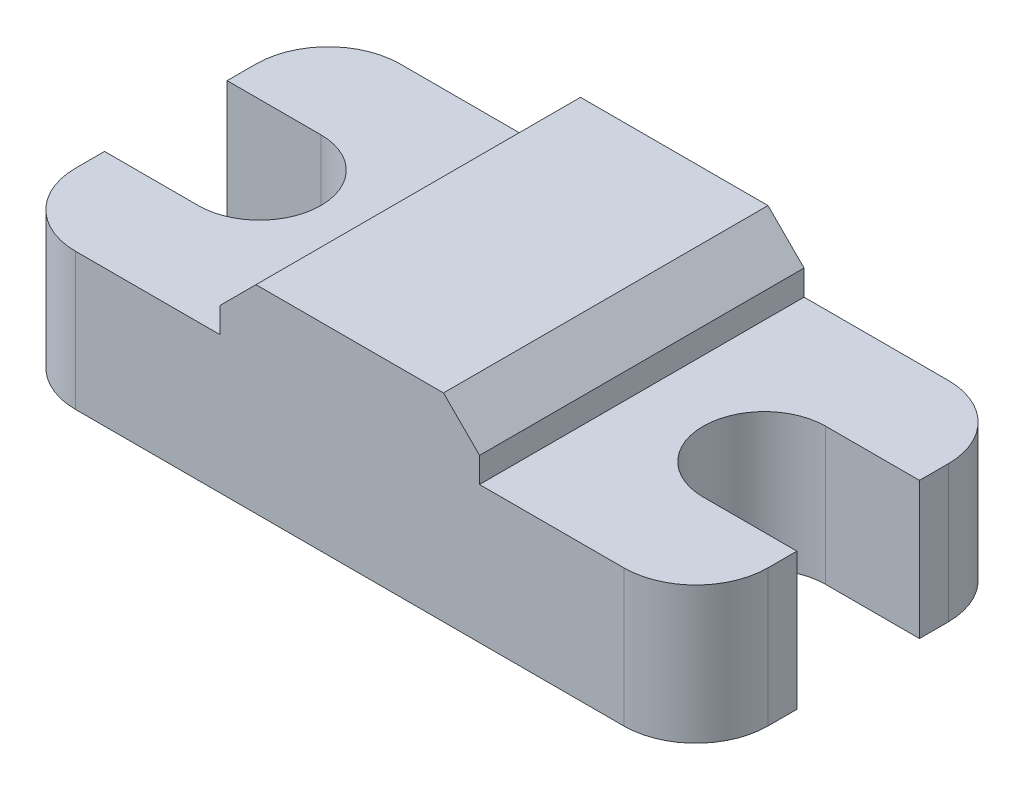
ISO-10303-21;
HEADER;
FILE_DESCRIPTION(('STEP AP214'),'2;1');
FILE_NAME('part.step','',(''),(''),'','','');
FILE_SCHEMA(('AUTOMOTIVE_DESIGN { 1 0 10303 214 1 1 1 1 }'));
ENDSEC;
DATA;
#1=APPLICATION_CONTEXT('core data for automotive mechanical design processes');
#2=APPLICATION_PROTOCOL_DEFINITION('international standard','automotive_design',2000,#1);
#3=PRODUCT_CONTEXT('',#1,'mechanical');
#4=PRODUCT('Part','Part','',(#3));
#5=PRODUCT_RELATED_PRODUCT_CATEGORY('part','',(#4));
#6=PRODUCT_DEFINITION_FORMATION('','',#4);
#7=PRODUCT_DEFINITION_CONTEXT('part definition',#1,'design');
#8=PRODUCT_DEFINITION('design','',#6,#7);
#9=PRODUCT_DEFINITION_SHAPE('','',#8);
#10=(LENGTH_UNIT() NAMED_UNIT(*) SI_UNIT(.MILLI.,.METRE.));
#11=(NAMED_UNIT(*) PLANE_ANGLE_UNIT() SI_UNIT($,.RADIAN.));
#12=(NAMED_UNIT(*) SI_UNIT($,.STERADIAN.) SOLID_ANGLE_UNIT());
#13=UNCERTAINTY_MEASURE_WITH_UNIT(LENGTH_MEASURE(1.E-05),#10,'distance_accuracy_value','');
#14=(GEOMETRIC_REPRESENTATION_CONTEXT(3) GLOBAL_UNCERTAINTY_ASSIGNED_CONTEXT((#13)) GLOBAL_UNIT_ASSIGNED_CONTEXT((#10,
#11,#12)) REPRESENTATION_CONTEXT('',''));
#15=CARTESIAN_POINT('',(0.,0.,0.));
#16=DIRECTION('',(0.,0.,1.));
#17=DIRECTION('',(1.,0.,0.));
#18=AXIS2_PLACEMENT_3D('',#15,#16,#17);
#19=CARTESIAN_POINT('',(2.,3.8,-7.));
#20=DIRECTION('',(0.,-1.,0.));
#21=DIRECTION('',(0.,0.,-1.));
#22=AXIS2_PLACEMENT_3D('',#19,#20,#21);
#23=PLANE('',#22);
#24=DIRECTION('',(0.,0.,-1.));
#25=VECTOR('',#24,1.);
#26=CARTESIAN_POINT('',(13.2,3.8,-9.));
#27=LINE('',#26,#25);
#28=CARTESIAN_POINT('',(13.2,3.8,0.));
#29=VERTEX_POINT('',#28);
#30=CARTESIAN_POINT('',(13.2,3.8,-9.));
#31=VERTEX_POINT('',#30);
#32=EDGE_CURVE('E205',#29,#31,#27,.T.);
#33=ORIENTED_EDGE('',*,*,#32,.F.);
#34=DIRECTION('',(1.,0.,0.));
#35=VECTOR('',#34,1.);
#36=CARTESIAN_POINT('',(2.00000000000001,3.8,0.));
#37=LINE('',#36,#35);
#38=CARTESIAN_POINT('',(17.2,3.8,0.));
#39=VERTEX_POINT('',#38);
#40=EDGE_CURVE('E200',#29,#39,#37,.T.);
#41=ORIENTED_EDGE('',*,*,#40,.T.);
#42=CARTESIAN_POINT('',(17.2,3.8,-2.));
#43=DIRECTION('',(0.,1.,0.));
#44=DIRECTION('',(0.,0.,1.));
#45=AXIS2_PLACEMENT_3D('',#42,#43,#44);
#46=CIRCLE('',#45,2.);
#47=CARTESIAN_POINT('',(19.2,3.8,-2.00000000000001));
#48=VERTEX_POINT('',#47);
#49=EDGE_CURVE('E199',#39,#48,#46,.T.);
#50=ORIENTED_EDGE('',*,*,#49,.T.);
#51=DIRECTION('',(0.,0.,-1.));
#52=VECTOR('',#51,1.);
#53=CARTESIAN_POINT('',(19.2,3.8,-2.00000000000001));
#54=LINE('',#53,#52);
#55=CARTESIAN_POINT('',(19.2,3.8,-2.8));
#56=VERTEX_POINT('',#55);
#57=EDGE_CURVE('E233',#48,#56,#54,.T.);
#58=ORIENTED_EDGE('',*,*,#57,.T.);
#59=DIRECTION('',(-1.,0.,0.));
#60=VECTOR('',#59,1.);
#61=CARTESIAN_POINT('',(19.2,3.8,-2.8));
#62=LINE('',#61,#60);
#63=CARTESIAN_POINT('',(16.6,3.8,-2.8));
#64=VERTEX_POINT('',#63);
#65=EDGE_CURVE('E235',#56,#64,#62,.T.);
#66=ORIENTED_EDGE('',*,*,#65,.T.);
#67=CARTESIAN_POINT('',(16.6,3.8,-4.5));
#68=DIRECTION('',(0.,-1.,0.));
#69=DIRECTION('',(0.,0.,1.));
#70=AXIS2_PLACEMENT_3D('',#67,#68,#69);
#71=CIRCLE('',#70,1.7);
#72=CARTESIAN_POINT('',(16.6,3.8,-6.2));
#73=VERTEX_POINT('',#72);
#74=EDGE_CURVE('E237',#64,#73,#71,.T.);
#75=ORIENTED_EDGE('',*,*,#74,.T.);
#76=DIRECTION('',(1.,0.,0.));
#77=VECTOR('',#76,1.);
#78=CARTESIAN_POINT('',(19.2,3.8,-6.2));
#79=LINE('',#78,#77);
#80=CARTESIAN_POINT('',(19.2,3.8,-6.2));
#81=VERTEX_POINT('',#80);
#82=EDGE_CURVE('E239',#73,#81,#79,.T.);
#83=ORIENTED_EDGE('',*,*,#82,.T.);
#84=DIRECTION('',(0.,0.,-1.));
#85=VECTOR('',#84,1.);
#86=CARTESIAN_POINT('',(19.2,3.8,-6.2));
#87=LINE('',#86,#85);
#88=CARTESIAN_POINT('',(19.2,3.8,-6.99999999999999));
#89=VERTEX_POINT('',#88);
#90=EDGE_CURVE('E241',#81,#89,#87,.T.);
#91=ORIENTED_EDGE('',*,*,#90,.T.);
#92=CARTESIAN_POINT('',(17.2,3.8,-7.));
#93=DIRECTION('',(0.,1.,0.));
#94=DIRECTION('',(0.,0.,-1.));
#95=AXIS2_PLACEMENT_3D('',#92,#93,#94);
#96=CIRCLE('',#95,2.);
#97=CARTESIAN_POINT('',(17.2,3.8,-9.));
#98=VERTEX_POINT('',#97);
#99=EDGE_CURVE('E243',#89,#98,#96,.T.);
#100=ORIENTED_EDGE('',*,*,#99,.T.);
#101=DIRECTION('',(-1.,0.,0.));
#102=VECTOR('',#101,1.);
#103=CARTESIAN_POINT('',(2.00000000000001,3.8,-9.));
#104=LINE('',#103,#102);
#105=EDGE_CURVE('E246',#98,#31,#104,.T.);
#106=ORIENTED_EDGE('',*,*,#105,.T.);
#107=EDGE_LOOP('',(#33,#41,#50,#58,#66,#75,#83,#91,#100,#106));
#108=FACE_BOUND('',#107,.T.);
#109=ADVANCED_FACE('F33',(#108),#23,.F.);
#110=DIRECTION('',(0.,0.,1.));
#111=VECTOR('',#110,1.);
#112=CARTESIAN_POINT('',(6.,3.8,-9.));
#113=LINE('',#112,#111);
#114=CARTESIAN_POINT('',(6.,3.8,-9.));
#115=VERTEX_POINT('',#114);
#116=CARTESIAN_POINT('',(6.,3.8,0.));
#117=VERTEX_POINT('',#116);
#118=EDGE_CURVE('E194',#115,#117,#113,.T.);
#119=ORIENTED_EDGE('',*,*,#118,.F.);
#120=CARTESIAN_POINT('',(2.00000000000001,3.8,-9.));
#121=VERTEX_POINT('',#120);
#122=EDGE_CURVE('E245',#115,#121,#104,.T.);
#123=ORIENTED_EDGE('',*,*,#122,.T.);
#124=CARTESIAN_POINT('',(2.,3.8,-7.));
#125=DIRECTION('',(0.,1.,0.));
#126=DIRECTION('',(0.,0.,-1.));
#127=AXIS2_PLACEMENT_3D('',#124,#125,#126);
#128=CIRCLE('',#127,2.);
#129=CARTESIAN_POINT('',(0.,3.8,-6.99999999999998));
#130=VERTEX_POINT('',#129);
#131=EDGE_CURVE('E249',#121,#130,#128,.T.);
#132=ORIENTED_EDGE('',*,*,#131,.T.);
#133=DIRECTION('',(0.,0.,1.));
#134=VECTOR('',#133,1.);
#135=CARTESIAN_POINT('',(0.,3.8,-6.2));
#136=LINE('',#135,#134);
#137=CARTESIAN_POINT('',(0.,3.8,-6.2));
#138=VERTEX_POINT('',#137);
#139=EDGE_CURVE('E219',#130,#138,#136,.T.);
#140=ORIENTED_EDGE('',*,*,#139,.T.);
#141=DIRECTION('',(1.,0.,0.));
#142=VECTOR('',#141,1.);
#143=CARTESIAN_POINT('',(0.,3.8,-6.2));
#144=LINE('',#143,#142);
#145=CARTESIAN_POINT('',(2.6,3.8,-6.2));
#146=VERTEX_POINT('',#145);
#147=EDGE_CURVE('E222',#138,#146,#144,.T.);
#148=ORIENTED_EDGE('',*,*,#147,.T.);
#149=CARTESIAN_POINT('',(2.6,3.8,-4.5));
#150=DIRECTION('',(0.,-1.,0.));
#151=DIRECTION('',(0.,0.,1.));
#152=AXIS2_PLACEMENT_3D('',#149,#150,#151);
#153=CIRCLE('',#152,1.7);
#154=CARTESIAN_POINT('',(2.6,3.8,-2.8));
#155=VERTEX_POINT('',#154);
#156=EDGE_CURVE('E225',#146,#155,#153,.T.);
#157=ORIENTED_EDGE('',*,*,#156,.T.);
#158=DIRECTION('',(-1.,0.,0.));
#159=VECTOR('',#158,1.);
#160=CARTESIAN_POINT('',(0.,3.8,-2.8));
#161=LINE('',#160,#159);
#162=CARTESIAN_POINT('',(0.,3.8,-2.8));
#163=VERTEX_POINT('',#162);
#164=EDGE_CURVE('E227',#155,#163,#161,.T.);
#165=ORIENTED_EDGE('',*,*,#164,.T.);
#166=DIRECTION('',(0.,0.,1.));
#167=VECTOR('',#166,1.);
#168=CARTESIAN_POINT('',(0.,3.8,-2.00000000000001));
#169=LINE('',#168,#167);
#170=CARTESIAN_POINT('',(0.,3.8,-2.00000000000001));
#171=VERTEX_POINT('',#170);
#172=EDGE_CURVE('E229',#163,#171,#169,.T.);
#173=ORIENTED_EDGE('',*,*,#172,.T.);
#174=CARTESIAN_POINT('',(2.,3.8,-2.));
#175=DIRECTION('',(0.,1.,0.));
#176=DIRECTION('',(0.,0.,-1.));
#177=AXIS2_PLACEMENT_3D('',#174,#175,#176);
#178=CIRCLE('',#177,2.);
#179=CARTESIAN_POINT('',(2.00000000000001,3.8,0.));
#180=VERTEX_POINT('',#179);
#181=EDGE_CURVE('E197',#171,#180,#178,.T.);
#182=ORIENTED_EDGE('',*,*,#181,.T.);
#183=EDGE_CURVE('E184',#180,#117,#37,.T.);
#184=ORIENTED_EDGE('',*,*,#183,.T.);
#185=EDGE_LOOP('',(#119,#123,#132,#140,#148,#157,#165,#173,#182,#184));
#186=FACE_BOUND('',#185,.T.);
#187=ADVANCED_FACE('F193',(#186),#23,.F.);
#188=CARTESIAN_POINT('',(0.,3.8,-6.2));
#189=DIRECTION('',(1.,0.,0.));
#190=DIRECTION('',(0.,0.,-1.));
#191=AXIS2_PLACEMENT_3D('',#188,#189,#190);
#192=PLANE('',#191);
#193=DIRECTION('',(0.,0.,1.));
#194=VECTOR('',#193,1.);
#195=CARTESIAN_POINT('',(0.,0.,-6.2));
#196=LINE('',#195,#194);
#197=CARTESIAN_POINT('',(0.,0.,-6.99999999999998));
#198=VERTEX_POINT('',#197);
#199=CARTESIAN_POINT('',(0.,0.,-6.2));
#200=VERTEX_POINT('',#199);
#201=EDGE_CURVE('E218',#198,#200,#196,.T.);
#202=ORIENTED_EDGE('',*,*,#201,.T.);
#203=DIRECTION('',(0.,-1.,0.));
#204=VECTOR('',#203,1.);
#205=CARTESIAN_POINT('',(0.,3.8,-6.2));
#206=LINE('',#205,#204);
#207=EDGE_CURVE('E326',#138,#200,#206,.T.);
#208=ORIENTED_EDGE('',*,*,#207,.F.);
#209=ORIENTED_EDGE('',*,*,#139,.F.);
#210=DIRECTION('',(0.,-1.,0.));
#211=VECTOR('',#210,1.);
#212=CARTESIAN_POINT('',(0.,3.8,-6.99999999999998));
#213=LINE('',#212,#211);
#214=EDGE_CURVE('E251',#130,#198,#213,.T.);
#215=ORIENTED_EDGE('',*,*,#214,.T.);
#216=EDGE_LOOP('',(#202,#208,#209,#215));
#217=FACE_BOUND('',#216,.T.);
#218=ADVANCED_FACE('F405',(#217),#192,.F.);
#219=CARTESIAN_POINT('',(0.,3.8,-6.2));
#220=DIRECTION('',(0.,0.,-1.));
#221=DIRECTION('',(-1.,0.,0.));
#222=AXIS2_PLACEMENT_3D('',#219,#220,#221);
#223=PLANE('',#222);
#224=DIRECTION('',(1.,0.,0.));
#225=VECTOR('',#224,1.);
#226=CARTESIAN_POINT('',(0.,0.,-6.2));
#227=LINE('',#226,#225);
#228=CARTESIAN_POINT('',(2.6,0.,-6.2));
#229=VERTEX_POINT('',#228);
#230=EDGE_CURVE('E254',#200,#229,#227,.T.);
#231=ORIENTED_EDGE('',*,*,#230,.T.);
#232=DIRECTION('',(0.,-1.,0.));
#233=VECTOR('',#232,1.);
#234=CARTESIAN_POINT('',(2.6,3.8,-6.2));
#235=LINE('',#234,#233);
#236=EDGE_CURVE('E323',#146,#229,#235,.T.);
#237=ORIENTED_EDGE('',*,*,#236,.F.);
#238=ORIENTED_EDGE('',*,*,#147,.F.);
#239=ORIENTED_EDGE('',*,*,#207,.T.);
#240=EDGE_LOOP('',(#231,#237,#238,#239));
#241=FACE_BOUND('',#240,.T.);
#242=ADVANCED_FACE('F459',(#241),#223,.F.);
#243=CARTESIAN_POINT('',(2.6,3.8,-4.5));
#244=DIRECTION('',(0.,-1.,0.));
#245=DIRECTION('',(0.,0.,-1.));
#246=AXIS2_PLACEMENT_3D('',#243,#244,#245);
#247=CYLINDRICAL_SURFACE('',#246,1.7);
#248=CARTESIAN_POINT('',(2.6,0.,-4.5));
#249=DIRECTION('',(0.,-1.,0.));
#250=DIRECTION('',(0.,0.,1.));
#251=AXIS2_PLACEMENT_3D('',#248,#249,#250);
#252=CIRCLE('',#251,1.7);
#253=CARTESIAN_POINT('',(2.6,0.,-2.8));
#254=VERTEX_POINT('',#253);
#255=EDGE_CURVE('E256',#229,#254,#252,.T.);
#256=ORIENTED_EDGE('',*,*,#255,.T.);
#257=DIRECTION('',(0.,-1.,0.));
#258=VECTOR('',#257,1.);
#259=CARTESIAN_POINT('',(2.6,3.8,-2.8));
#260=LINE('',#259,#258);
#261=EDGE_CURVE('E320',#155,#254,#260,.T.);
#262=ORIENTED_EDGE('',*,*,#261,.F.);
#263=ORIENTED_EDGE('',*,*,#156,.F.);
#264=ORIENTED_EDGE('',*,*,#236,.T.);
#265=EDGE_LOOP('',(#256,#262,#263,#264));
#266=FACE_BOUND('',#265,.T.);
#267=ADVANCED_FACE('F455',(#266),#247,.F.);
#268=CARTESIAN_POINT('',(0.,3.8,-2.8));
#269=DIRECTION('',(0.,0.,1.));
#270=DIRECTION('',(1.,0.,0.));
#271=AXIS2_PLACEMENT_3D('',#268,#269,#270);
#272=PLANE('',#271);
#273=DIRECTION('',(-1.,0.,0.));
#274=VECTOR('',#273,1.);
#275=CARTESIAN_POINT('',(0.,0.,-2.8));
#276=LINE('',#275,#274);
#277=CARTESIAN_POINT('',(0.,0.,-2.8));
#278=VERTEX_POINT('',#277);
#279=EDGE_CURVE('E258',#254,#278,#276,.T.);
#280=ORIENTED_EDGE('',*,*,#279,.T.);
#281=DIRECTION('',(0.,-1.,0.));
#282=VECTOR('',#281,1.);
#283=CARTESIAN_POINT('',(0.,3.8,-2.8));
#284=LINE('',#283,#282);
#285=EDGE_CURVE('E317',#163,#278,#284,.T.);
#286=ORIENTED_EDGE('',*,*,#285,.F.);
#287=ORIENTED_EDGE('',*,*,#164,.F.);
#288=ORIENTED_EDGE('',*,*,#261,.T.);
#289=EDGE_LOOP('',(#280,#286,#287,#288));
#290=FACE_BOUND('',#289,.T.);
#291=ADVANCED_FACE('F451',(#290),#272,.F.);
#292=CARTESIAN_POINT('',(0.,3.8,-2.00000000000001));
#293=DIRECTION('',(1.,0.,0.));
#294=DIRECTION('',(0.,0.,-1.));
#295=AXIS2_PLACEMENT_3D('',#292,#293,#294);
#296=PLANE('',#295);
#297=DIRECTION('',(0.,0.,1.));
#298=VECTOR('',#297,1.);
#299=CARTESIAN_POINT('',(0.,0.,-2.00000000000001));
#300=LINE('',#299,#298);
#301=CARTESIAN_POINT('',(0.,0.,-2.00000000000001));
#302=VERTEX_POINT('',#301);
#303=EDGE_CURVE('E260',#278,#302,#300,.T.);
#304=ORIENTED_EDGE('',*,*,#303,.T.);
#305=DIRECTION('',(0.,-1.,0.));
#306=VECTOR('',#305,1.);
#307=CARTESIAN_POINT('',(0.,3.8,-2.00000000000001));
#308=LINE('',#307,#306);
#309=EDGE_CURVE('E314',#171,#302,#308,.T.);
#310=ORIENTED_EDGE('',*,*,#309,.F.);
#311=ORIENTED_EDGE('',*,*,#172,.F.);
#312=ORIENTED_EDGE('',*,*,#285,.T.);
#313=EDGE_LOOP('',(#304,#310,#311,#312));
#314=FACE_BOUND('',#313,.T.);
#315=ADVANCED_FACE('F447',(#314),#296,.F.);
#316=CARTESIAN_POINT('',(2.,3.8,-2.));
#317=DIRECTION('',(0.,-1.,0.));
#318=DIRECTION('',(0.,0.,-1.));
#319=AXIS2_PLACEMENT_3D('',#316,#317,#318);
#320=CYLINDRICAL_SURFACE('',#319,2.);
#321=CARTESIAN_POINT('',(2.,0.,-2.));
#322=DIRECTION('',(0.,1.,0.));
#323=DIRECTION('',(0.,0.,-1.));
#324=AXIS2_PLACEMENT_3D('',#321,#322,#323);
#325=CIRCLE('',#324,2.);
#326=CARTESIAN_POINT('',(2.00000000000001,0.,0.));
#327=VERTEX_POINT('',#326);
#328=EDGE_CURVE('E262',#302,#327,#325,.T.);
#329=ORIENTED_EDGE('',*,*,#328,.T.);
#330=DIRECTION('',(0.,-1.,0.));
#331=VECTOR('',#330,1.);
#332=CARTESIAN_POINT('',(2.00000000000001,3.8,0.));
#333=LINE('',#332,#331);
#334=EDGE_CURVE('E312',#180,#327,#333,.T.);
#335=ORIENTED_EDGE('',*,*,#334,.F.);
#336=ORIENTED_EDGE('',*,*,#181,.F.);
#337=ORIENTED_EDGE('',*,*,#309,.T.);
#338=EDGE_LOOP('',(#329,#335,#336,#337));
#339=FACE_BOUND('',#338,.T.);
#340=ADVANCED_FACE('F444',(#339),#320,.T.);
#341=CARTESIAN_POINT('',(2.00000000000001,3.8,0.));
#342=DIRECTION('',(0.,0.,-1.));
#343=DIRECTION('',(-1.,0.,0.));
#344=AXIS2_PLACEMENT_3D('',#341,#342,#343);
#345=PLANE('',#344);
#346=DIRECTION('',(0.,-1.,0.));
#347=VECTOR('',#346,1.);
#348=CARTESIAN_POINT('',(13.2,5.5,0.));
#349=LINE('',#348,#347);
#350=CARTESIAN_POINT('',(13.2,4.49999999999999,0.));
#351=VERTEX_POINT('',#350);
#352=EDGE_CURVE('E189',#351,#29,#349,.T.);
#353=ORIENTED_EDGE('',*,*,#352,.F.);
#354=DIRECTION('',(0.707106781186546,-0.707106781186549,0.));
#355=VECTOR('',#354,1.);
#356=CARTESIAN_POINT('',(12.2,5.5,0.));
#357=LINE('',#356,#355);
#358=CARTESIAN_POINT('',(12.2,5.5,0.));
#359=VERTEX_POINT('',#358);
#360=EDGE_CURVE('E41',#351,#359,#357,.F.);
#361=ORIENTED_EDGE('',*,*,#360,.T.);
#362=DIRECTION('',(1.,0.,0.));
#363=VECTOR('',#362,1.);
#364=CARTESIAN_POINT('',(13.2,5.5,0.));
#365=LINE('',#364,#363);
#366=CARTESIAN_POINT('',(7.,5.5,0.));
#367=VERTEX_POINT('',#366);
#368=EDGE_CURVE('E208',#367,#359,#365,.T.);
#369=ORIENTED_EDGE('',*,*,#368,.F.);
#370=DIRECTION('',(0.707106781186546,0.707106781186549,0.));
#371=VECTOR('',#370,1.);
#372=CARTESIAN_POINT('',(7.,5.5,0.));
#373=LINE('',#372,#371);
#374=CARTESIAN_POINT('',(6.,4.5,0.));
#375=VERTEX_POINT('',#374);
#376=EDGE_CURVE('E48',#367,#375,#373,.F.);
#377=ORIENTED_EDGE('',*,*,#376,.T.);
#378=DIRECTION('',(0.,-1.,0.));
#379=VECTOR('',#378,1.);
#380=CARTESIAN_POINT('',(6.,5.5,0.));
#381=LINE('',#380,#379);
#382=EDGE_CURVE('E180',#375,#117,#381,.T.);
#383=ORIENTED_EDGE('',*,*,#382,.T.);
#384=ORIENTED_EDGE('',*,*,#183,.F.);
#385=ORIENTED_EDGE('',*,*,#334,.T.);
#386=DIRECTION('',(1.,0.,0.));
#387=VECTOR('',#386,1.);
#388=CARTESIAN_POINT('',(2.00000000000001,0.,0.));
#389=LINE('',#388,#387);
#390=CARTESIAN_POINT('',(17.2,0.,0.));
#391=VERTEX_POINT('',#390);
#392=EDGE_CURVE('E264',#327,#391,#389,.T.);
#393=ORIENTED_EDGE('',*,*,#392,.T.);
#394=DIRECTION('',(0.,-1.,0.));
#395=VECTOR('',#394,1.);
#396=CARTESIAN_POINT('',(17.2,3.8,0.));
#397=LINE('',#396,#395);
#398=EDGE_CURVE('E309',#39,#391,#397,.T.);
#399=ORIENTED_EDGE('',*,*,#398,.F.);
#400=ORIENTED_EDGE('',*,*,#40,.F.);
#401=EDGE_LOOP('',(#353,#361,#369,#377,#383,#384,#385,#393,#399,#400));
#402=FACE_BOUND('',#401,.T.);
#403=ADVANCED_FACE('F182',(#402),#345,.F.);
#404=CARTESIAN_POINT('',(17.2,3.8,-2.));
#405=DIRECTION('',(0.,-1.,0.));
#406=DIRECTION('',(0.,0.,-1.));
#407=AXIS2_PLACEMENT_3D('',#404,#405,#406);
#408=CYLINDRICAL_SURFACE('',#407,2.);
#409=CARTESIAN_POINT('',(17.2,0.,-2.));
#410=DIRECTION('',(0.,1.,0.));
#411=DIRECTION('',(0.,0.,1.));
#412=AXIS2_PLACEMENT_3D('',#409,#410,#411);
#413=CIRCLE('',#412,2.);
#414=CARTESIAN_POINT('',(19.2,0.,-2.00000000000001));
#415=VERTEX_POINT('',#414);
#416=EDGE_CURVE('E266',#391,#415,#413,.T.);
#417=ORIENTED_EDGE('',*,*,#416,.T.);
#418=DIRECTION('',(0.,-1.,0.));
#419=VECTOR('',#418,1.);
#420=CARTESIAN_POINT('',(19.2,3.8,-2.00000000000001));
#421=LINE('',#420,#419);
#422=EDGE_CURVE('E306',#48,#415,#421,.T.);
#423=ORIENTED_EDGE('',*,*,#422,.F.);
#424=ORIENTED_EDGE('',*,*,#49,.F.);
#425=ORIENTED_EDGE('',*,*,#398,.T.);
#426=EDGE_LOOP('',(#417,#423,#424,#425));
#427=FACE_BOUND('',#426,.T.);
#428=ADVANCED_FACE('F362',(#427),#408,.T.);
#429=CARTESIAN_POINT('',(19.2,3.8,-2.00000000000001));
#430=DIRECTION('',(-1.,0.,0.));
#431=DIRECTION('',(0.,0.,1.));
#432=AXIS2_PLACEMENT_3D('',#429,#430,#431);
#433=PLANE('',#432);
#434=DIRECTION('',(0.,0.,-1.));
#435=VECTOR('',#434,1.);
#436=CARTESIAN_POINT('',(19.2,0.,-2.00000000000001));
#437=LINE('',#436,#435);
#438=CARTESIAN_POINT('',(19.2,0.,-2.8));
#439=VERTEX_POINT('',#438);
#440=EDGE_CURVE('E268',#415,#439,#437,.T.);
#441=ORIENTED_EDGE('',*,*,#440,.T.);
#442=DIRECTION('',(0.,-1.,0.));
#443=VECTOR('',#442,1.);
#444=CARTESIAN_POINT('',(19.2,3.8,-2.8));
#445=LINE('',#444,#443);
#446=EDGE_CURVE('E303',#56,#439,#445,.T.);
#447=ORIENTED_EDGE('',*,*,#446,.F.);
#448=ORIENTED_EDGE('',*,*,#57,.F.);
#449=ORIENTED_EDGE('',*,*,#422,.T.);
#450=EDGE_LOOP('',(#441,#447,#448,#449));
#451=FACE_BOUND('',#450,.T.);
#452=ADVANCED_FACE('F368',(#451),#433,.F.);
#453=CARTESIAN_POINT('',(19.2,3.8,-2.8));
#454=DIRECTION('',(0.,0.,1.));
#455=DIRECTION('',(1.,0.,0.));
#456=AXIS2_PLACEMENT_3D('',#453,#454,#455);
#457=PLANE('',#456);
#458=DIRECTION('',(-1.,0.,0.));
#459=VECTOR('',#458,1.);
#460=CARTESIAN_POINT('',(19.2,0.,-2.8));
#461=LINE('',#460,#459);
#462=CARTESIAN_POINT('',(16.6,0.,-2.8));
#463=VERTEX_POINT('',#462);
#464=EDGE_CURVE('E270',#439,#463,#461,.T.);
#465=ORIENTED_EDGE('',*,*,#464,.T.);
#466=DIRECTION('',(0.,-1.,0.));
#467=VECTOR('',#466,1.);
#468=CARTESIAN_POINT('',(16.6,3.8,-2.8));
#469=LINE('',#468,#467);
#470=EDGE_CURVE('E300',#64,#463,#469,.T.);
#471=ORIENTED_EDGE('',*,*,#470,.F.);
#472=ORIENTED_EDGE('',*,*,#65,.F.);
#473=ORIENTED_EDGE('',*,*,#446,.T.);
#474=EDGE_LOOP('',(#465,#471,#472,#473));
#475=FACE_BOUND('',#474,.T.);
#476=ADVANCED_FACE('F372',(#475),#457,.F.);
#477=CARTESIAN_POINT('',(16.6,3.8,-4.5));
#478=DIRECTION('',(0.,-1.,0.));
#479=DIRECTION('',(0.,0.,-1.));
#480=AXIS2_PLACEMENT_3D('',#477,#478,#479);
#481=CYLINDRICAL_SURFACE('',#480,1.7);
#482=CARTESIAN_POINT('',(16.6,0.,-4.5));
#483=DIRECTION('',(0.,-1.,0.));
#484=DIRECTION('',(0.,0.,1.));
#485=AXIS2_PLACEMENT_3D('',#482,#483,#484);
#486=CIRCLE('',#485,1.7);
#487=CARTESIAN_POINT('',(16.6,0.,-6.2));
#488=VERTEX_POINT('',#487);
#489=EDGE_CURVE('E272',#463,#488,#486,.T.);
#490=ORIENTED_EDGE('',*,*,#489,.T.);
#491=DIRECTION('',(0.,-1.,0.));
#492=VECTOR('',#491,1.);
#493=CARTESIAN_POINT('',(16.6,3.8,-6.2));
#494=LINE('',#493,#492);
#495=EDGE_CURVE('E297',#73,#488,#494,.T.);
#496=ORIENTED_EDGE('',*,*,#495,.F.);
#497=ORIENTED_EDGE('',*,*,#74,.F.);
#498=ORIENTED_EDGE('',*,*,#470,.T.);
#499=EDGE_LOOP('',(#490,#496,#497,#498));
#500=FACE_BOUND('',#499,.T.);
#501=ADVANCED_FACE('F377',(#500),#481,.F.);
#502=CARTESIAN_POINT('',(19.2,3.8,-6.2));
#503=DIRECTION('',(0.,0.,-1.));
#504=DIRECTION('',(-1.,0.,0.));
#505=AXIS2_PLACEMENT_3D('',#502,#503,#504);
#506=PLANE('',#505);
#507=DIRECTION('',(1.,0.,0.));
#508=VECTOR('',#507,1.);
#509=CARTESIAN_POINT('',(19.2,0.,-6.2));
#510=LINE('',#509,#508);
#511=CARTESIAN_POINT('',(19.2,0.,-6.2));
#512=VERTEX_POINT('',#511);
#513=EDGE_CURVE('E274',#488,#512,#510,.T.);
#514=ORIENTED_EDGE('',*,*,#513,.T.);
#515=DIRECTION('',(0.,-1.,0.));
#516=VECTOR('',#515,1.);
#517=CARTESIAN_POINT('',(19.2,3.8,-6.2));
#518=LINE('',#517,#516);
#519=EDGE_CURVE('E294',#81,#512,#518,.T.);
#520=ORIENTED_EDGE('',*,*,#519,.F.);
#521=ORIENTED_EDGE('',*,*,#82,.F.);
#522=ORIENTED_EDGE('',*,*,#495,.T.);
#523=EDGE_LOOP('',(#514,#520,#521,#522));
#524=FACE_BOUND('',#523,.T.);
#525=ADVANCED_FACE('F383',(#524),#506,.F.);
#526=CARTESIAN_POINT('',(19.2,3.8,-6.2));
#527=DIRECTION('',(-1.,0.,0.));
#528=DIRECTION('',(0.,0.,1.));
#529=AXIS2_PLACEMENT_3D('',#526,#527,#528);
#530=PLANE('',#529);
#531=DIRECTION('',(0.,0.,-1.));
#532=VECTOR('',#531,1.);
#533=CARTESIAN_POINT('',(19.2,0.,-6.2));
#534=LINE('',#533,#532);
#535=CARTESIAN_POINT('',(19.2,0.,-6.99999999999999));
#536=VERTEX_POINT('',#535);
#537=EDGE_CURVE('E276',#512,#536,#534,.T.);
#538=ORIENTED_EDGE('',*,*,#537,.T.);
#539=DIRECTION('',(0.,-1.,0.));
#540=VECTOR('',#539,1.);
#541=CARTESIAN_POINT('',(19.2,3.8,-6.99999999999999));
#542=LINE('',#541,#540);
#543=EDGE_CURVE('E291',#89,#536,#542,.T.);
#544=ORIENTED_EDGE('',*,*,#543,.F.);
#545=ORIENTED_EDGE('',*,*,#90,.F.);
#546=ORIENTED_EDGE('',*,*,#519,.T.);
#547=EDGE_LOOP('',(#538,#544,#545,#546));
#548=FACE_BOUND('',#547,.T.);
#549=ADVANCED_FACE('F387',(#548),#530,.F.);
#550=CARTESIAN_POINT('',(17.2,3.8,-7.));
#551=DIRECTION('',(0.,-1.,0.));
#552=DIRECTION('',(0.,0.,-1.));
#553=AXIS2_PLACEMENT_3D('',#550,#551,#552);
#554=CYLINDRICAL_SURFACE('',#553,2.);
#555=CARTESIAN_POINT('',(17.2,0.,-7.));
#556=DIRECTION('',(0.,1.,0.));
#557=DIRECTION('',(0.,0.,-1.));
#558=AXIS2_PLACEMENT_3D('',#555,#556,#557);
#559=CIRCLE('',#558,2.);
#560=CARTESIAN_POINT('',(17.2,0.,-9.));
#561=VERTEX_POINT('',#560);
#562=EDGE_CURVE('E278',#536,#561,#559,.T.);
#563=ORIENTED_EDGE('',*,*,#562,.T.);
#564=DIRECTION('',(0.,-1.,0.));
#565=VECTOR('',#564,1.);
#566=CARTESIAN_POINT('',(17.2,3.8,-9.));
#567=LINE('',#566,#565);
#568=EDGE_CURVE('E288',#98,#561,#567,.T.);
#569=ORIENTED_EDGE('',*,*,#568,.F.);
#570=ORIENTED_EDGE('',*,*,#99,.F.);
#571=ORIENTED_EDGE('',*,*,#543,.T.);
#572=EDGE_LOOP('',(#563,#569,#570,#571));
#573=FACE_BOUND('',#572,.T.);
#574=ADVANCED_FACE('F392',(#573),#554,.T.);
#575=CARTESIAN_POINT('',(2.00000000000001,3.8,-9.));
#576=DIRECTION('',(0.,0.,1.));
#577=DIRECTION('',(1.,0.,0.));
#578=AXIS2_PLACEMENT_3D('',#575,#576,#577);
#579=PLANE('',#578);
#580=DIRECTION('',(-1.,0.,0.));
#581=VECTOR('',#580,1.);
#582=CARTESIAN_POINT('',(13.2,5.5,-9.));
#583=LINE('',#582,#581);
#584=CARTESIAN_POINT('',(12.2,5.5,-9.));
#585=VERTEX_POINT('',#584);
#586=CARTESIAN_POINT('',(7.,5.5,-9.));
#587=VERTEX_POINT('',#586);
#588=EDGE_CURVE('E204',#585,#587,#583,.T.);
#589=ORIENTED_EDGE('',*,*,#588,.F.);
#590=DIRECTION('',(-0.707106781186546,0.707106781186549,0.));
#591=VECTOR('',#590,1.);
#592=CARTESIAN_POINT('',(12.2,5.5,-9.));
#593=LINE('',#592,#591);
#594=CARTESIAN_POINT('',(13.2,4.49999999999999,-9.));
#595=VERTEX_POINT('',#594);
#596=EDGE_CURVE('E337',#585,#595,#593,.F.);
#597=ORIENTED_EDGE('',*,*,#596,.T.);
#598=DIRECTION('',(0.,-1.,0.));
#599=VECTOR('',#598,1.);
#600=CARTESIAN_POINT('',(13.2,5.5,-9.));
#601=LINE('',#600,#599);
#602=EDGE_CURVE('E216',#595,#31,#601,.T.);
#603=ORIENTED_EDGE('',*,*,#602,.T.);
#604=ORIENTED_EDGE('',*,*,#105,.F.);
#605=ORIENTED_EDGE('',*,*,#568,.T.);
#606=DIRECTION('',(-1.,0.,0.));
#607=VECTOR('',#606,1.);
#608=CARTESIAN_POINT('',(2.00000000000001,0.,-9.));
#609=LINE('',#608,#607);
#610=CARTESIAN_POINT('',(2.00000000000001,0.,-9.));
#611=VERTEX_POINT('',#610);
#612=EDGE_CURVE('E280',#561,#611,#609,.T.);
#613=ORIENTED_EDGE('',*,*,#612,.T.);
#614=DIRECTION('',(0.,-1.,0.));
#615=VECTOR('',#614,1.);
#616=CARTESIAN_POINT('',(2.00000000000001,3.8,-9.));
#617=LINE('',#616,#615);
#618=EDGE_CURVE('E285',#121,#611,#617,.T.);
#619=ORIENTED_EDGE('',*,*,#618,.F.);
#620=ORIENTED_EDGE('',*,*,#122,.F.);
#621=DIRECTION('',(0.,-1.,0.));
#622=VECTOR('',#621,1.);
#623=CARTESIAN_POINT('',(6.,5.5,-9.));
#624=LINE('',#623,#622);
#625=CARTESIAN_POINT('',(6.,4.5,-9.));
#626=VERTEX_POINT('',#625);
#627=EDGE_CURVE('E188',#626,#115,#624,.T.);
#628=ORIENTED_EDGE('',*,*,#627,.F.);
#629=DIRECTION('',(-0.707106781186546,-0.707106781186549,0.));
#630=VECTOR('',#629,1.);
#631=CARTESIAN_POINT('',(7.,5.5,-9.));
#632=LINE('',#631,#630);
#633=EDGE_CURVE('E335',#626,#587,#632,.F.);
#634=ORIENTED_EDGE('',*,*,#633,.T.);
#635=EDGE_LOOP('',(#589,#597,#603,#604,#605,#613,#619,#620,#628,#634));
#636=FACE_BOUND('',#635,.T.);
#637=ADVANCED_FACE('F351',(#636),#579,.F.);
#638=CARTESIAN_POINT('',(2.,3.8,-7.));
#639=DIRECTION('',(0.,-1.,0.));
#640=DIRECTION('',(0.,0.,-1.));
#641=AXIS2_PLACEMENT_3D('',#638,#639,#640);
#642=CYLINDRICAL_SURFACE('',#641,2.);
#643=CARTESIAN_POINT('',(2.,0.,-7.));
#644=DIRECTION('',(0.,1.,0.));
#645=DIRECTION('',(0.,0.,-1.));
#646=AXIS2_PLACEMENT_3D('',#643,#644,#645);
#647=CIRCLE('',#646,2.);
#648=EDGE_CURVE('E223',#611,#198,#647,.T.);
#649=ORIENTED_EDGE('',*,*,#648,.T.);
#650=ORIENTED_EDGE('',*,*,#214,.F.);
#651=ORIENTED_EDGE('',*,*,#131,.F.);
#652=ORIENTED_EDGE('',*,*,#618,.T.);
#653=EDGE_LOOP('',(#649,#650,#651,#652));
#654=FACE_BOUND('',#653,.T.);
#655=ADVANCED_FACE('F401',(#654),#642,.T.);
#656=CARTESIAN_POINT('',(2.,0.,-7.));
#657=DIRECTION('',(0.,-1.,0.));
#658=DIRECTION('',(0.,0.,-1.));
#659=AXIS2_PLACEMENT_3D('',#656,#657,#658);
#660=PLANE('',#659);
#661=ORIENTED_EDGE('',*,*,#201,.F.);
#662=ORIENTED_EDGE('',*,*,#648,.F.);
#663=ORIENTED_EDGE('',*,*,#612,.F.);
#664=ORIENTED_EDGE('',*,*,#562,.F.);
#665=ORIENTED_EDGE('',*,*,#537,.F.);
#666=ORIENTED_EDGE('',*,*,#513,.F.);
#667=ORIENTED_EDGE('',*,*,#489,.F.);
#668=ORIENTED_EDGE('',*,*,#464,.F.);
#669=ORIENTED_EDGE('',*,*,#440,.F.);
#670=ORIENTED_EDGE('',*,*,#416,.F.);
#671=ORIENTED_EDGE('',*,*,#392,.F.);
#672=ORIENTED_EDGE('',*,*,#328,.F.);
#673=ORIENTED_EDGE('',*,*,#303,.F.);
#674=ORIENTED_EDGE('',*,*,#279,.F.);
#675=ORIENTED_EDGE('',*,*,#255,.F.);
#676=ORIENTED_EDGE('',*,*,#230,.F.);
#677=EDGE_LOOP('',(#661,#662,#663,#664,#665,#666,#667,#668,#669,#670,#671,#672,#673,#674,#675,#676));
#678=FACE_BOUND('',#677,.T.);
#679=ADVANCED_FACE('F398',(#678),#660,.T.);
#680=CARTESIAN_POINT('',(13.2,5.5,-9.));
#681=DIRECTION('',(-1.,0.,0.));
#682=DIRECTION('',(0.,0.,1.));
#683=AXIS2_PLACEMENT_3D('',#680,#681,#682);
#684=PLANE('',#683);
#685=ORIENTED_EDGE('',*,*,#602,.F.);
#686=DIRECTION('',(0.,0.,1.));
#687=VECTOR('',#686,1.);
#688=CARTESIAN_POINT('',(13.2,4.49999999999999,-9.));
#689=LINE('',#688,#687);
#690=EDGE_CURVE('E56',#595,#351,#689,.T.);
#691=ORIENTED_EDGE('',*,*,#690,.T.);
#692=ORIENTED_EDGE('',*,*,#352,.T.);
#693=ORIENTED_EDGE('',*,*,#32,.T.);
#694=EDGE_LOOP('',(#685,#691,#692,#693));
#695=FACE_BOUND('',#694,.T.);
#696=ADVANCED_FACE('F353',(#695),#684,.F.);
#697=CARTESIAN_POINT('',(6.,5.5,-9.));
#698=DIRECTION('',(1.,0.,0.));
#699=DIRECTION('',(0.,0.,-1.));
#700=AXIS2_PLACEMENT_3D('',#697,#698,#699);
#701=PLANE('',#700);
#702=ORIENTED_EDGE('',*,*,#382,.F.);
#703=DIRECTION('',(0.,0.,-1.));
#704=VECTOR('',#703,1.);
#705=CARTESIAN_POINT('',(6.,4.5,-9.));
#706=LINE('',#705,#704);
#707=EDGE_CURVE('E11',#375,#626,#706,.T.);
#708=ORIENTED_EDGE('',*,*,#707,.T.);
#709=ORIENTED_EDGE('',*,*,#627,.T.);
#710=ORIENTED_EDGE('',*,*,#118,.T.);
#711=EDGE_LOOP('',(#702,#708,#709,#710));
#712=FACE_BOUND('',#711,.T.);
#713=ADVANCED_FACE('F202',(#712),#701,.F.);
#714=CARTESIAN_POINT('',(0.,5.5,0.));
#715=DIRECTION('',(0.,-1.,0.));
#716=DIRECTION('',(0.,0.,-1.));
#717=AXIS2_PLACEMENT_3D('',#714,#715,#716);
#718=PLANE('',#717);
#719=ORIENTED_EDGE('',*,*,#368,.T.);
#720=DIRECTION('',(0.,0.,-1.));
#721=VECTOR('',#720,1.);
#722=CARTESIAN_POINT('',(12.2,5.5,0.));
#723=LINE('',#722,#721);
#724=EDGE_CURVE('E332',#359,#585,#723,.T.);
#725=ORIENTED_EDGE('',*,*,#724,.T.);
#726=ORIENTED_EDGE('',*,*,#588,.T.);
#727=DIRECTION('',(0.,0.,1.));
#728=VECTOR('',#727,1.);
#729=CARTESIAN_POINT('',(7.,5.5,0.));
#730=LINE('',#729,#728);
#731=EDGE_CURVE('E329',#587,#367,#730,.T.);
#732=ORIENTED_EDGE('',*,*,#731,.T.);
#733=EDGE_LOOP('',(#719,#725,#726,#732));
#734=FACE_BOUND('',#733,.T.);
#735=ADVANCED_FACE('F346',(#734),#718,.F.);
#736=CARTESIAN_POINT('',(12.2,5.5,0.));
#737=DIRECTION('',(-0.707106781186549,-0.707106781186546,0.));
#738=DIRECTION('',(0.,0.,-1.));
#739=AXIS2_PLACEMENT_3D('',#736,#737,#738);
#740=PLANE('',#739);
#741=ORIENTED_EDGE('',*,*,#360,.F.);
#742=ORIENTED_EDGE('',*,*,#690,.F.);
#743=ORIENTED_EDGE('',*,*,#596,.F.);
#744=ORIENTED_EDGE('',*,*,#724,.F.);
#745=EDGE_LOOP('',(#741,#742,#743,#744));
#746=FACE_BOUND('',#745,.T.);
#747=ADVANCED_FACE('F349',(#746),#740,.F.);
#748=CARTESIAN_POINT('',(7.,5.5,0.));
#749=DIRECTION('',(0.707106781186549,-0.707106781186546,0.));
#750=DIRECTION('',(0.,0.,1.));
#751=AXIS2_PLACEMENT_3D('',#748,#749,#750);
#752=PLANE('',#751);
#753=ORIENTED_EDGE('',*,*,#633,.F.);
#754=ORIENTED_EDGE('',*,*,#707,.F.);
#755=ORIENTED_EDGE('',*,*,#376,.F.);
#756=ORIENTED_EDGE('',*,*,#731,.F.);
#757=EDGE_LOOP('',(#753,#754,#755,#756));
#758=FACE_BOUND('',#757,.T.);
#759=ADVANCED_FACE('F35',(#758),#752,.F.);
#760=CLOSED_SHELL('',(#109,#187,#218,#242,#267,#291,#315,#340,#403,#428,#452,#476,#501,#525,
#549,#574,#637,#655,#679,#696,#713,#735,#747,#759));
#761=MANIFOLD_SOLID_BREP('B2',#760);
#762=ADVANCED_BREP_SHAPE_REPRESENTATION('',(#18,#761),#14);
#763=SHAPE_DEFINITION_REPRESENTATION(#9,#762);
ENDSEC;
END-ISO-10303-21;
